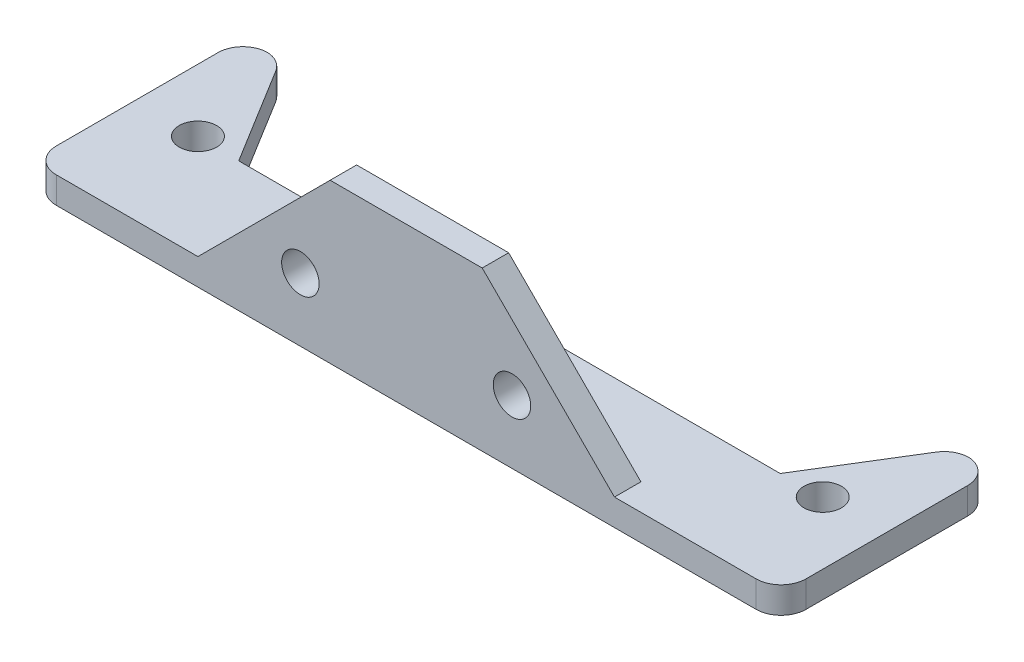
ISO-10303-21;
HEADER;
FILE_DESCRIPTION(('STEP AP214'),'2;1');
FILE_NAME('part.step','',(''),(''),'','','');
FILE_SCHEMA(('AUTOMOTIVE_DESIGN { 1 0 10303 214 1 1 1 1 }'));
ENDSEC;
DATA;
#1=APPLICATION_CONTEXT('core data for automotive mechanical design processes');
#2=APPLICATION_PROTOCOL_DEFINITION('international standard','automotive_design',2000,#1);
#3=PRODUCT_CONTEXT('',#1,'mechanical');
#4=PRODUCT('Part','Part','',(#3));
#5=PRODUCT_RELATED_PRODUCT_CATEGORY('part','',(#4));
#6=PRODUCT_DEFINITION_FORMATION('','',#4);
#7=PRODUCT_DEFINITION_CONTEXT('part definition',#1,'design');
#8=PRODUCT_DEFINITION('design','',#6,#7);
#9=PRODUCT_DEFINITION_SHAPE('','',#8);
#10=(LENGTH_UNIT() NAMED_UNIT(*) SI_UNIT(.MILLI.,.METRE.));
#11=(NAMED_UNIT(*) PLANE_ANGLE_UNIT() SI_UNIT($,.RADIAN.));
#12=(NAMED_UNIT(*) SI_UNIT($,.STERADIAN.) SOLID_ANGLE_UNIT());
#13=UNCERTAINTY_MEASURE_WITH_UNIT(LENGTH_MEASURE(1.E-05),#10,'distance_accuracy_value','');
#14=(GEOMETRIC_REPRESENTATION_CONTEXT(3) GLOBAL_UNCERTAINTY_ASSIGNED_CONTEXT((#13)) GLOBAL_UNIT_ASSIGNED_CONTEXT((#10,
#11,#12)) REPRESENTATION_CONTEXT('',''));
#15=CARTESIAN_POINT('',(0.,0.,0.));
#16=DIRECTION('',(0.,0.,1.));
#17=DIRECTION('',(1.,0.,0.));
#18=AXIS2_PLACEMENT_3D('',#15,#16,#17);
#19=CARTESIAN_POINT('',(25.,0.,-3.175));
#20=DIRECTION('',(0.,-1.,0.));
#21=DIRECTION('',(0.,0.,-1.));
#22=AXIS2_PLACEMENT_3D('',#19,#20,#21);
#23=PLANE('',#22);
#24=DIRECTION('',(-1.,0.,0.));
#25=VECTOR('',#24,1.);
#26=CARTESIAN_POINT('',(25.,0.,0.));
#27=LINE('',#26,#25);
#28=CARTESIAN_POINT('',(9.12500000000006,0.,0.));
#29=VERTEX_POINT('',#28);
#30=CARTESIAN_POINT('',(-9.12499999999983,0.,0.));
#31=VERTEX_POINT('',#30);
#32=EDGE_CURVE('E253',#29,#31,#27,.T.);
#33=ORIENTED_EDGE('',*,*,#32,.F.);
#34=DIRECTION('',(0.,0.,-1.));
#35=VECTOR('',#34,1.);
#36=CARTESIAN_POINT('',(9.12500000000006,0.,0.));
#37=LINE('',#36,#35);
#38=CARTESIAN_POINT('',(9.12500000000006,0.,-3.175));
#39=VERTEX_POINT('',#38);
#40=EDGE_CURVE('E237',#29,#39,#37,.T.);
#41=ORIENTED_EDGE('',*,*,#40,.T.);
#42=DIRECTION('',(-1.,0.,0.));
#43=VECTOR('',#42,1.);
#44=CARTESIAN_POINT('',(25.,0.,-3.175));
#45=LINE('',#44,#43);
#46=CARTESIAN_POINT('',(-9.12499999999983,0.,-3.175));
#47=VERTEX_POINT('',#46);
#48=EDGE_CURVE('E240',#39,#47,#45,.T.);
#49=ORIENTED_EDGE('',*,*,#48,.T.);
#50=DIRECTION('',(0.,0.,-1.));
#51=VECTOR('',#50,1.);
#52=CARTESIAN_POINT('',(-9.12499999999983,0.,0.));
#53=LINE('',#52,#51);
#54=EDGE_CURVE('E244',#31,#47,#53,.T.);
#55=ORIENTED_EDGE('',*,*,#54,.F.);
#56=EDGE_LOOP('',(#33,#41,#49,#55));
#57=FACE_BOUND('',#56,.T.);
#58=ADVANCED_FACE('F41',(#57),#23,.F.);
#59=CARTESIAN_POINT('',(25.,0.,0.));
#60=DIRECTION('',(0.,0.,-1.));
#61=DIRECTION('',(0.,1.,0.));
#62=AXIS2_PLACEMENT_3D('',#59,#60,#61);
#63=PLANE('',#62);
#64=CARTESIAN_POINT('',(12.7,-11.4453125,0.));
#65=DIRECTION('',(0.,0.,-1.));
#66=DIRECTION('',(0.,1.,0.));
#67=AXIS2_PLACEMENT_3D('',#64,#65,#66);
#68=CIRCLE('',#67,2.25);
#69=CARTESIAN_POINT('',(12.7,-9.1953125,0.));
#70=VERTEX_POINT('',#69);
#71=EDGE_CURVE('E222',#70,#70,#68,.T.);
#72=ORIENTED_EDGE('',*,*,#71,.T.);
#73=EDGE_LOOP('',(#72));
#74=FACE_BOUND('',#73,.T.);
#75=CARTESIAN_POINT('',(-12.7,-11.4453125,0.));
#76=DIRECTION('',(0.,0.,-1.));
#77=DIRECTION('',(0.,1.,0.));
#78=AXIS2_PLACEMENT_3D('',#75,#76,#77);
#79=CIRCLE('',#78,2.25);
#80=CARTESIAN_POINT('',(-12.7,-9.1953125,0.));
#81=VERTEX_POINT('',#80);
#82=EDGE_CURVE('E228',#81,#81,#79,.T.);
#83=ORIENTED_EDGE('',*,*,#82,.T.);
#84=EDGE_LOOP('',(#83));
#85=FACE_BOUND('',#84,.T.);
#86=DIRECTION('',(-1.,0.,0.));
#87=VECTOR('',#86,1.);
#88=CARTESIAN_POINT('',(25.,-19.05,0.));
#89=LINE('',#88,#87);
#90=CARTESIAN_POINT('',(42.,-19.05,0.));
#91=VERTEX_POINT('',#90);
#92=CARTESIAN_POINT('',(-42.,-19.05,0.));
#93=VERTEX_POINT('',#92);
#94=EDGE_CURVE('E250',#91,#93,#89,.T.);
#95=ORIENTED_EDGE('',*,*,#94,.F.);
#96=DIRECTION('',(0.,-1.,0.));
#97=VECTOR('',#96,1.);
#98=CARTESIAN_POINT('',(42.,-15.875,0.));
#99=LINE('',#98,#97);
#100=CARTESIAN_POINT('',(42.,-15.875,0.));
#101=VERTEX_POINT('',#100);
#102=EDGE_CURVE('E293',#91,#101,#99,.F.);
#103=ORIENTED_EDGE('',*,*,#102,.T.);
#104=DIRECTION('',(-1.,0.,0.));
#105=VECTOR('',#104,1.);
#106=CARTESIAN_POINT('',(45.,-15.875,0.));
#107=LINE('',#106,#105);
#108=CARTESIAN_POINT('',(25.,-15.875,0.));
#109=VERTEX_POINT('',#108);
#110=EDGE_CURVE('E217',#101,#109,#107,.T.);
#111=ORIENTED_EDGE('',*,*,#110,.T.);
#112=DIRECTION('',(-0.707106781186546,0.707106781186549,0.));
#113=VECTOR('',#112,1.);
#114=CARTESIAN_POINT('',(25.,-15.875,0.));
#115=LINE('',#114,#113);
#116=EDGE_CURVE('E232',#109,#29,#115,.T.);
#117=ORIENTED_EDGE('',*,*,#116,.T.);
#118=ORIENTED_EDGE('',*,*,#32,.T.);
#119=DIRECTION('',(-0.707106781186551,-0.707106781186544,0.));
#120=VECTOR('',#119,1.);
#121=CARTESIAN_POINT('',(-25.,-15.875,0.));
#122=LINE('',#121,#120);
#123=CARTESIAN_POINT('',(-25.,-15.875,0.));
#124=VERTEX_POINT('',#123);
#125=EDGE_CURVE('E241',#31,#124,#122,.T.);
#126=ORIENTED_EDGE('',*,*,#125,.T.);
#127=DIRECTION('',(1.,0.,0.));
#128=VECTOR('',#127,1.);
#129=CARTESIAN_POINT('',(-45.,-15.875,0.));
#130=LINE('',#129,#128);
#131=CARTESIAN_POINT('',(-42.,-15.875,0.));
#132=VERTEX_POINT('',#131);
#133=EDGE_CURVE('E209',#132,#124,#130,.T.);
#134=ORIENTED_EDGE('',*,*,#133,.F.);
#135=DIRECTION('',(0.,1.,0.));
#136=VECTOR('',#135,1.);
#137=CARTESIAN_POINT('',(-42.,-19.05,0.));
#138=LINE('',#137,#136);
#139=EDGE_CURVE('E291',#132,#93,#138,.F.);
#140=ORIENTED_EDGE('',*,*,#139,.T.);
#141=EDGE_LOOP('',(#95,#103,#111,#117,#118,#126,#134,#140));
#142=FACE_BOUND('',#141,.T.);
#143=ADVANCED_FACE('F331',(#74,#85,#142),#63,.F.);
#144=CARTESIAN_POINT('',(25.,-19.05,0.));
#145=DIRECTION('',(0.,1.,0.));
#146=DIRECTION('',(0.,0.,1.));
#147=AXIS2_PLACEMENT_3D('',#144,#145,#146);
#148=PLANE('',#147);
#149=CARTESIAN_POINT('',(37.5,-19.05,-12.5));
#150=DIRECTION('',(0.,1.,0.));
#151=DIRECTION('',(0.,0.,1.));
#152=AXIS2_PLACEMENT_3D('',#149,#150,#151);
#153=CIRCLE('',#152,2.25);
#154=CARTESIAN_POINT('',(37.5,-19.05,-10.25));
#155=VERTEX_POINT('',#154);
#156=EDGE_CURVE('E194',#155,#155,#153,.T.);
#157=ORIENTED_EDGE('',*,*,#156,.T.);
#158=EDGE_LOOP('',(#157));
#159=FACE_BOUND('',#158,.T.);
#160=CARTESIAN_POINT('',(-37.5,-19.05,-12.5));
#161=DIRECTION('',(0.,1.,0.));
#162=DIRECTION('',(0.,0.,1.));
#163=AXIS2_PLACEMENT_3D('',#160,#161,#162);
#164=CIRCLE('',#163,2.25);
#165=CARTESIAN_POINT('',(-37.5,-19.05,-10.25));
#166=VERTEX_POINT('',#165);
#167=EDGE_CURVE('E200',#166,#166,#164,.T.);
#168=ORIENTED_EDGE('',*,*,#167,.T.);
#169=EDGE_LOOP('',(#168));
#170=FACE_BOUND('',#169,.T.);
#171=DIRECTION('',(0.,0.,-1.));
#172=VECTOR('',#171,1.);
#173=CARTESIAN_POINT('',(45.,-19.05,0.));
#174=LINE('',#173,#172);
#175=CARTESIAN_POINT('',(45.,-19.05,-3.));
#176=VERTEX_POINT('',#175);
#177=CARTESIAN_POINT('',(45.,-19.05,-22.4));
#178=VERTEX_POINT('',#177);
#179=EDGE_CURVE('E211',#176,#178,#174,.T.);
#180=ORIENTED_EDGE('',*,*,#179,.F.);
#181=CARTESIAN_POINT('',(42.,-19.05,-3.));
#182=DIRECTION('',(0.,1.,0.));
#183=DIRECTION('',(0.,0.,1.));
#184=AXIS2_PLACEMENT_3D('',#181,#182,#183);
#185=CIRCLE('',#184,3.);
#186=EDGE_CURVE('E289',#176,#91,#185,.F.);
#187=ORIENTED_EDGE('',*,*,#186,.T.);
#188=ORIENTED_EDGE('',*,*,#94,.T.);
#189=CARTESIAN_POINT('',(-42.,-19.05,-3.));
#190=DIRECTION('',(0.,1.,0.));
#191=DIRECTION('',(0.,0.,1.));
#192=AXIS2_PLACEMENT_3D('',#189,#190,#191);
#193=CIRCLE('',#192,3.);
#194=CARTESIAN_POINT('',(-45.,-19.05,-3.));
#195=VERTEX_POINT('',#194);
#196=EDGE_CURVE('E287',#93,#195,#193,.F.);
#197=ORIENTED_EDGE('',*,*,#196,.T.);
#198=DIRECTION('',(0.,0.,1.));
#199=VECTOR('',#198,1.);
#200=CARTESIAN_POINT('',(-45.,-19.05,-25.4));
#201=LINE('',#200,#199);
#202=CARTESIAN_POINT('',(-45.,-19.05,-22.4));
#203=VERTEX_POINT('',#202);
#204=EDGE_CURVE('E203',#203,#195,#201,.T.);
#205=ORIENTED_EDGE('',*,*,#204,.F.);
#206=CARTESIAN_POINT('',(-42.,-19.05,-22.4));
#207=DIRECTION('',(0.,1.,0.));
#208=DIRECTION('',(0.,0.,1.));
#209=AXIS2_PLACEMENT_3D('',#206,#207,#208);
#210=CIRCLE('',#209,3.);
#211=CARTESIAN_POINT('',(-42.0881927910547,-19.05,-25.3987033917355));
#212=VERTEX_POINT('',#211);
#213=EDGE_CURVE('E285',#203,#212,#210,.F.);
#214=ORIENTED_EDGE('',*,*,#213,.T.);
#215=CARTESIAN_POINT('',(-42.1763855821093,-19.05,-22.4));
#216=DIRECTION('',(0.,1.,0.));
#217=DIRECTION('',(0.,0.,1.));
#218=AXIS2_PLACEMENT_3D('',#215,#216,#217);
#219=CIRCLE('',#218,3.);
#220=CARTESIAN_POINT('',(-39.6214106319957,-19.05,-23.972292276993));
#221=VERTEX_POINT('',#220);
#222=EDGE_CURVE('E283',#212,#221,#219,.F.);
#223=ORIENTED_EDGE('',*,*,#222,.T.);
#224=DIRECTION('',(0.524097425664335,0.,0.851658316704544));
#225=VECTOR('',#224,1.);
#226=CARTESIAN_POINT('',(-18.0381974248927,-19.05,11.1004291845494));
#227=LINE('',#226,#225);
#228=CARTESIAN_POINT('',(-32.5,-19.05,-12.4));
#229=VERTEX_POINT('',#228);
#230=EDGE_CURVE('E169',#221,#229,#227,.T.);
#231=ORIENTED_EDGE('',*,*,#230,.T.);
#232=DIRECTION('',(1.,0.,0.));
#233=VECTOR('',#232,1.);
#234=CARTESIAN_POINT('',(0.,-19.05,-12.4));
#235=LINE('',#234,#233);
#236=CARTESIAN_POINT('',(32.5,-19.05,-12.4));
#237=VERTEX_POINT('',#236);
#238=EDGE_CURVE('E162',#229,#237,#235,.T.);
#239=ORIENTED_EDGE('',*,*,#238,.T.);
#240=DIRECTION('',(0.524097425664335,0.,-0.851658316704544));
#241=VECTOR('',#240,1.);
#242=CARTESIAN_POINT('',(18.0381974248927,-19.05,11.1004291845494));
#243=LINE('',#242,#241);
#244=CARTESIAN_POINT('',(39.6214106319957,-19.05,-23.972292276993));
#245=VERTEX_POINT('',#244);
#246=EDGE_CURVE('E172',#237,#245,#243,.T.);
#247=ORIENTED_EDGE('',*,*,#246,.T.);
#248=CARTESIAN_POINT('',(42.1763855821093,-19.05,-22.4));
#249=DIRECTION('',(0.,1.,0.));
#250=DIRECTION('',(0.,0.,1.));
#251=AXIS2_PLACEMENT_3D('',#248,#249,#250);
#252=CIRCLE('',#251,3.);
#253=CARTESIAN_POINT('',(42.0881927910547,-19.05,-25.3987033917355));
#254=VERTEX_POINT('',#253);
#255=EDGE_CURVE('E281',#245,#254,#252,.F.);
#256=ORIENTED_EDGE('',*,*,#255,.T.);
#257=CARTESIAN_POINT('',(42.,-19.05,-22.4));
#258=DIRECTION('',(0.,1.,0.));
#259=DIRECTION('',(0.,0.,1.));
#260=AXIS2_PLACEMENT_3D('',#257,#258,#259);
#261=CIRCLE('',#260,3.);
#262=EDGE_CURVE('E279',#254,#178,#261,.F.);
#263=ORIENTED_EDGE('',*,*,#262,.T.);
#264=EDGE_LOOP('',(#180,#187,#188,#197,#205,#214,#223,#231,#239,#247,#256,#263));
#265=FACE_BOUND('',#264,.T.);
#266=ADVANCED_FACE('F178',(#159,#170,#265),#148,.F.);
#267=CARTESIAN_POINT('',(25.,-15.875,-25.4));
#268=DIRECTION('',(0.,-1.,0.));
#269=DIRECTION('',(0.,0.,-1.));
#270=AXIS2_PLACEMENT_3D('',#267,#268,#269);
#271=PLANE('',#270);
#272=CARTESIAN_POINT('',(37.5,-15.875,-12.5));
#273=DIRECTION('',(0.,1.,0.));
#274=DIRECTION('',(0.,0.,1.));
#275=AXIS2_PLACEMENT_3D('',#272,#273,#274);
#276=CIRCLE('',#275,2.24999999999999);
#277=CARTESIAN_POINT('',(37.5,-15.875,-10.25));
#278=VERTEX_POINT('',#277);
#279=EDGE_CURVE('E190',#278,#278,#276,.T.);
#280=ORIENTED_EDGE('',*,*,#279,.F.);
#281=EDGE_LOOP('',(#280));
#282=FACE_BOUND('',#281,.T.);
#283=CARTESIAN_POINT('',(-37.5,-15.875,-12.5));
#284=DIRECTION('',(0.,1.,0.));
#285=DIRECTION('',(0.,0.,1.));
#286=AXIS2_PLACEMENT_3D('',#283,#284,#285);
#287=CIRCLE('',#286,2.24999999999999);
#288=CARTESIAN_POINT('',(-37.5,-15.875,-10.25));
#289=VERTEX_POINT('',#288);
#290=EDGE_CURVE('E197',#289,#289,#287,.T.);
#291=ORIENTED_EDGE('',*,*,#290,.F.);
#292=EDGE_LOOP('',(#291));
#293=FACE_BOUND('',#292,.T.);
#294=ORIENTED_EDGE('',*,*,#110,.F.);
#295=CARTESIAN_POINT('',(42.,-15.875,-3.));
#296=DIRECTION('',(0.,-1.,0.));
#297=DIRECTION('',(0.,0.,-1.));
#298=AXIS2_PLACEMENT_3D('',#295,#296,#297);
#299=CIRCLE('',#298,3.);
#300=CARTESIAN_POINT('',(45.,-15.875,-3.));
#301=VERTEX_POINT('',#300);
#302=EDGE_CURVE('E303',#101,#301,#299,.F.);
#303=ORIENTED_EDGE('',*,*,#302,.T.);
#304=DIRECTION('',(0.,0.,1.));
#305=VECTOR('',#304,1.);
#306=CARTESIAN_POINT('',(45.,-15.875,0.));
#307=LINE('',#306,#305);
#308=CARTESIAN_POINT('',(45.,-15.875,-22.4));
#309=VERTEX_POINT('',#308);
#310=EDGE_CURVE('E214',#309,#301,#307,.T.);
#311=ORIENTED_EDGE('',*,*,#310,.F.);
#312=CARTESIAN_POINT('',(42.,-15.875,-22.4));
#313=DIRECTION('',(0.,-1.,0.));
#314=DIRECTION('',(0.,0.,-1.));
#315=AXIS2_PLACEMENT_3D('',#312,#313,#314);
#316=CIRCLE('',#315,3.);
#317=CARTESIAN_POINT('',(42.0881927910547,-15.875,-25.3987033917355));
#318=VERTEX_POINT('',#317);
#319=EDGE_CURVE('E65',#309,#318,#316,.F.);
#320=ORIENTED_EDGE('',*,*,#319,.T.);
#321=CARTESIAN_POINT('',(42.1763855821093,-15.875,-22.4));
#322=DIRECTION('',(0.,-1.,0.));
#323=DIRECTION('',(0.,0.,-1.));
#324=AXIS2_PLACEMENT_3D('',#321,#322,#323);
#325=CIRCLE('',#324,3.);
#326=CARTESIAN_POINT('',(39.6214106319957,-15.875,-23.972292276993));
#327=VERTEX_POINT('',#326);
#328=EDGE_CURVE('E296',#318,#327,#325,.F.);
#329=ORIENTED_EDGE('',*,*,#328,.T.);
#330=DIRECTION('',(0.524097425664335,0.,-0.851658316704544));
#331=VECTOR('',#330,1.);
#332=CARTESIAN_POINT('',(18.0381974248927,-15.875,11.1004291845494));
#333=LINE('',#332,#331);
#334=CARTESIAN_POINT('',(32.5,-15.875,-12.4));
#335=VERTEX_POINT('',#334);
#336=EDGE_CURVE('E183',#335,#327,#333,.T.);
#337=ORIENTED_EDGE('',*,*,#336,.F.);
#338=DIRECTION('',(1.,0.,0.));
#339=VECTOR('',#338,1.);
#340=CARTESIAN_POINT('',(0.,-15.875,-12.4));
#341=LINE('',#340,#339);
#342=CARTESIAN_POINT('',(-32.5,-15.875,-12.4));
#343=VERTEX_POINT('',#342);
#344=EDGE_CURVE('E164',#343,#335,#341,.T.);
#345=ORIENTED_EDGE('',*,*,#344,.F.);
#346=DIRECTION('',(0.524097425664335,0.,0.851658316704544));
#347=VECTOR('',#346,1.);
#348=CARTESIAN_POINT('',(-18.0381974248927,-15.875,11.1004291845494));
#349=LINE('',#348,#347);
#350=CARTESIAN_POINT('',(-39.6214106319957,-15.875,-23.972292276993));
#351=VERTEX_POINT('',#350);
#352=EDGE_CURVE('E181',#351,#343,#349,.T.);
#353=ORIENTED_EDGE('',*,*,#352,.F.);
#354=CARTESIAN_POINT('',(-42.1763855821093,-15.875,-22.4));
#355=DIRECTION('',(0.,-1.,0.));
#356=DIRECTION('',(0.,0.,-1.));
#357=AXIS2_PLACEMENT_3D('',#354,#355,#356);
#358=CIRCLE('',#357,3.);
#359=CARTESIAN_POINT('',(-42.0881927910547,-15.875,-25.3987033917355));
#360=VERTEX_POINT('',#359);
#361=EDGE_CURVE('E58',#351,#360,#358,.F.);
#362=ORIENTED_EDGE('',*,*,#361,.T.);
#363=CARTESIAN_POINT('',(-42.,-15.875,-22.4));
#364=DIRECTION('',(0.,-1.,0.));
#365=DIRECTION('',(0.,0.,-1.));
#366=AXIS2_PLACEMENT_3D('',#363,#364,#365);
#367=CIRCLE('',#366,3.);
#368=CARTESIAN_POINT('',(-45.,-15.875,-22.4));
#369=VERTEX_POINT('',#368);
#370=EDGE_CURVE('E299',#360,#369,#367,.F.);
#371=ORIENTED_EDGE('',*,*,#370,.T.);
#372=DIRECTION('',(0.,0.,-1.));
#373=VECTOR('',#372,1.);
#374=CARTESIAN_POINT('',(-45.,-15.875,-25.4));
#375=LINE('',#374,#373);
#376=CARTESIAN_POINT('',(-45.,-15.875,-3.));
#377=VERTEX_POINT('',#376);
#378=EDGE_CURVE('E206',#377,#369,#375,.T.);
#379=ORIENTED_EDGE('',*,*,#378,.F.);
#380=CARTESIAN_POINT('',(-42.,-15.875,-3.));
#381=DIRECTION('',(0.,-1.,0.));
#382=DIRECTION('',(0.,0.,-1.));
#383=AXIS2_PLACEMENT_3D('',#380,#381,#382);
#384=CIRCLE('',#383,3.);
#385=EDGE_CURVE('E301',#377,#132,#384,.F.);
#386=ORIENTED_EDGE('',*,*,#385,.T.);
#387=ORIENTED_EDGE('',*,*,#133,.T.);
#388=DIRECTION('',(0.,0.,-1.));
#389=VECTOR('',#388,1.);
#390=CARTESIAN_POINT('',(-25.,-15.875,0.));
#391=LINE('',#390,#389);
#392=CARTESIAN_POINT('',(-25.,-15.875,-3.175));
#393=VERTEX_POINT('',#392);
#394=EDGE_CURVE('E246',#124,#393,#391,.T.);
#395=ORIENTED_EDGE('',*,*,#394,.T.);
#396=DIRECTION('',(-1.,0.,0.));
#397=VECTOR('',#396,1.);
#398=CARTESIAN_POINT('',(25.,-15.875,-3.175));
#399=LINE('',#398,#397);
#400=CARTESIAN_POINT('',(25.,-15.875,-3.175));
#401=VERTEX_POINT('',#400);
#402=EDGE_CURVE('E249',#401,#393,#399,.T.);
#403=ORIENTED_EDGE('',*,*,#402,.F.);
#404=DIRECTION('',(0.,0.,-1.));
#405=VECTOR('',#404,1.);
#406=CARTESIAN_POINT('',(25.,-15.875,0.));
#407=LINE('',#406,#405);
#408=EDGE_CURVE('E235',#109,#401,#407,.T.);
#409=ORIENTED_EDGE('',*,*,#408,.F.);
#410=EDGE_LOOP('',(#294,#303,#311,#320,#329,#337,#345,#353,#362,#371,#379,#386,#387,#395,#403,#409));
#411=FACE_BOUND('',#410,.T.);
#412=ADVANCED_FACE('F350',(#282,#293,#411),#271,.F.);
#413=CARTESIAN_POINT('',(25.,-15.875,-3.175));
#414=DIRECTION('',(0.,0.,1.));
#415=DIRECTION('',(0.,-1.,0.));
#416=AXIS2_PLACEMENT_3D('',#413,#414,#415);
#417=PLANE('',#416);
#418=CARTESIAN_POINT('',(12.7,-11.4453125,-3.175));
#419=DIRECTION('',(0.,0.,-1.));
#420=DIRECTION('',(0.,1.,0.));
#421=AXIS2_PLACEMENT_3D('',#418,#419,#420);
#422=CIRCLE('',#421,2.24999999999999);
#423=CARTESIAN_POINT('',(12.7,-9.19531250000001,-3.175));
#424=VERTEX_POINT('',#423);
#425=EDGE_CURVE('E219',#424,#424,#422,.T.);
#426=ORIENTED_EDGE('',*,*,#425,.F.);
#427=EDGE_LOOP('',(#426));
#428=FACE_BOUND('',#427,.T.);
#429=CARTESIAN_POINT('',(-12.7,-11.4453125,-3.175));
#430=DIRECTION('',(0.,0.,-1.));
#431=DIRECTION('',(0.,1.,0.));
#432=AXIS2_PLACEMENT_3D('',#429,#430,#431);
#433=CIRCLE('',#432,2.24999999999999);
#434=CARTESIAN_POINT('',(-12.7,-9.19531250000001,-3.175));
#435=VERTEX_POINT('',#434);
#436=EDGE_CURVE('E225',#435,#435,#433,.T.);
#437=ORIENTED_EDGE('',*,*,#436,.F.);
#438=EDGE_LOOP('',(#437));
#439=FACE_BOUND('',#438,.T.);
#440=ORIENTED_EDGE('',*,*,#48,.F.);
#441=DIRECTION('',(-0.707106781186546,0.707106781186549,0.));
#442=VECTOR('',#441,1.);
#443=CARTESIAN_POINT('',(25.,-15.875,-3.175));
#444=LINE('',#443,#442);
#445=EDGE_CURVE('E236',#401,#39,#444,.T.);
#446=ORIENTED_EDGE('',*,*,#445,.F.);
#447=ORIENTED_EDGE('',*,*,#402,.T.);
#448=DIRECTION('',(-0.707106781186551,-0.707106781186544,0.));
#449=VECTOR('',#448,1.);
#450=CARTESIAN_POINT('',(-25.,-15.875,-3.175));
#451=LINE('',#450,#449);
#452=EDGE_CURVE('E231',#47,#393,#451,.T.);
#453=ORIENTED_EDGE('',*,*,#452,.F.);
#454=EDGE_LOOP('',(#440,#446,#447,#453));
#455=FACE_BOUND('',#454,.T.);
#456=ADVANCED_FACE('F353',(#428,#439,#455),#417,.F.);
#457=CARTESIAN_POINT('',(-25.,-15.875,0.));
#458=DIRECTION('',(0.707106781186544,-0.707106781186551,0.));
#459=DIRECTION('',(0.707106781186551,0.707106781186544,0.));
#460=AXIS2_PLACEMENT_3D('',#457,#458,#459);
#461=PLANE('',#460);
#462=ORIENTED_EDGE('',*,*,#452,.T.);
#463=ORIENTED_EDGE('',*,*,#394,.F.);
#464=ORIENTED_EDGE('',*,*,#125,.F.);
#465=ORIENTED_EDGE('',*,*,#54,.T.);
#466=EDGE_LOOP('',(#462,#463,#464,#465));
#467=FACE_BOUND('',#466,.T.);
#468=ADVANCED_FACE('F361',(#467),#461,.F.);
#469=CARTESIAN_POINT('',(25.,-15.875,0.));
#470=DIRECTION('',(-0.707106781186549,-0.707106781186546,0.));
#471=DIRECTION('',(0.707106781186546,-0.707106781186549,0.));
#472=AXIS2_PLACEMENT_3D('',#469,#470,#471);
#473=PLANE('',#472);
#474=ORIENTED_EDGE('',*,*,#445,.T.);
#475=ORIENTED_EDGE('',*,*,#40,.F.);
#476=ORIENTED_EDGE('',*,*,#116,.F.);
#477=ORIENTED_EDGE('',*,*,#408,.T.);
#478=EDGE_LOOP('',(#474,#475,#476,#477));
#479=FACE_BOUND('',#478,.T.);
#480=ADVANCED_FACE('F484',(#479),#473,.F.);
#481=CARTESIAN_POINT('',(-12.7,-11.4453125,-3.175));
#482=DIRECTION('',(0.,0.,-1.));
#483=DIRECTION('',(0.,1.,0.));
#484=AXIS2_PLACEMENT_3D('',#481,#482,#483);
#485=CYLINDRICAL_SURFACE('',#484,2.24999999999999);
#486=ORIENTED_EDGE('',*,*,#82,.F.);
#487=EDGE_LOOP('',(#486));
#488=FACE_BOUND('',#487,.T.);
#489=ORIENTED_EDGE('',*,*,#436,.T.);
#490=EDGE_LOOP('',(#489));
#491=FACE_BOUND('',#490,.T.);
#492=ADVANCED_FACE('F492',(#488,#491),#485,.F.);
#493=CARTESIAN_POINT('',(12.7,-11.4453125,-3.175));
#494=DIRECTION('',(0.,0.,-1.));
#495=DIRECTION('',(0.,1.,0.));
#496=AXIS2_PLACEMENT_3D('',#493,#494,#495);
#497=CYLINDRICAL_SURFACE('',#496,2.24999999999999);
#498=ORIENTED_EDGE('',*,*,#71,.F.);
#499=EDGE_LOOP('',(#498));
#500=FACE_BOUND('',#499,.T.);
#501=ORIENTED_EDGE('',*,*,#425,.T.);
#502=EDGE_LOOP('',(#501));
#503=FACE_BOUND('',#502,.T.);
#504=ADVANCED_FACE('F440',(#500,#503),#497,.F.);
#505=CARTESIAN_POINT('',(45.,0.,0.));
#506=DIRECTION('',(1.,0.,0.));
#507=DIRECTION('',(0.,0.,-1.));
#508=AXIS2_PLACEMENT_3D('',#505,#506,#507);
#509=PLANE('',#508);
#510=ORIENTED_EDGE('',*,*,#310,.T.);
#511=DIRECTION('',(0.,-1.,0.));
#512=VECTOR('',#511,1.);
#513=CARTESIAN_POINT('',(45.,-19.05,-3.));
#514=LINE('',#513,#512);
#515=EDGE_CURVE('E276',#301,#176,#514,.T.);
#516=ORIENTED_EDGE('',*,*,#515,.T.);
#517=ORIENTED_EDGE('',*,*,#179,.T.);
#518=DIRECTION('',(0.,1.,0.));
#519=VECTOR('',#518,1.);
#520=CARTESIAN_POINT('',(45.,-15.875,-22.4));
#521=LINE('',#520,#519);
#522=EDGE_CURVE('E256',#178,#309,#521,.T.);
#523=ORIENTED_EDGE('',*,*,#522,.T.);
#524=EDGE_LOOP('',(#510,#516,#517,#523));
#525=FACE_BOUND('',#524,.T.);
#526=ADVANCED_FACE('F322',(#525),#509,.T.);
#527=CARTESIAN_POINT('',(-45.,0.,0.));
#528=DIRECTION('',(-1.,0.,0.));
#529=DIRECTION('',(0.,0.,1.));
#530=AXIS2_PLACEMENT_3D('',#527,#528,#529);
#531=PLANE('',#530);
#532=ORIENTED_EDGE('',*,*,#204,.T.);
#533=DIRECTION('',(0.,1.,0.));
#534=VECTOR('',#533,1.);
#535=CARTESIAN_POINT('',(-45.,-15.875,-3.));
#536=LINE('',#535,#534);
#537=EDGE_CURVE('E308',#195,#377,#536,.T.);
#538=ORIENTED_EDGE('',*,*,#537,.T.);
#539=ORIENTED_EDGE('',*,*,#378,.T.);
#540=DIRECTION('',(0.,-1.,0.));
#541=VECTOR('',#540,1.);
#542=CARTESIAN_POINT('',(-45.,-19.05,-22.4));
#543=LINE('',#542,#541);
#544=EDGE_CURVE('E305',#369,#203,#543,.T.);
#545=ORIENTED_EDGE('',*,*,#544,.T.);
#546=EDGE_LOOP('',(#532,#538,#539,#545));
#547=FACE_BOUND('',#546,.T.);
#548=ADVANCED_FACE('F340',(#547),#531,.T.);
#549=CARTESIAN_POINT('',(-37.5,-15.875,-12.5));
#550=DIRECTION('',(0.,1.,0.));
#551=DIRECTION('',(0.,0.,1.));
#552=AXIS2_PLACEMENT_3D('',#549,#550,#551);
#553=CYLINDRICAL_SURFACE('',#552,2.25);
#554=ORIENTED_EDGE('',*,*,#167,.F.);
#555=EDGE_LOOP('',(#554));
#556=FACE_BOUND('',#555,.T.);
#557=ORIENTED_EDGE('',*,*,#290,.T.);
#558=EDGE_LOOP('',(#557));
#559=FACE_BOUND('',#558,.T.);
#560=ADVANCED_FACE('F433',(#556,#559),#553,.F.);
#561=CARTESIAN_POINT('',(37.5,-15.875,-12.5));
#562=DIRECTION('',(0.,1.,0.));
#563=DIRECTION('',(0.,0.,1.));
#564=AXIS2_PLACEMENT_3D('',#561,#562,#563);
#565=CYLINDRICAL_SURFACE('',#564,2.25);
#566=ORIENTED_EDGE('',*,*,#156,.F.);
#567=EDGE_LOOP('',(#566));
#568=FACE_BOUND('',#567,.T.);
#569=ORIENTED_EDGE('',*,*,#279,.T.);
#570=EDGE_LOOP('',(#569));
#571=FACE_BOUND('',#570,.T.);
#572=ADVANCED_FACE('F511',(#568,#571),#565,.F.);
#573=CARTESIAN_POINT('',(0.,-19.05,-12.4));
#574=DIRECTION('',(0.,0.,1.));
#575=DIRECTION('',(0.,-1.,0.));
#576=AXIS2_PLACEMENT_3D('',#573,#574,#575);
#577=PLANE('',#576);
#578=ORIENTED_EDGE('',*,*,#344,.T.);
#579=DIRECTION('',(0.,1.,0.));
#580=VECTOR('',#579,1.);
#581=CARTESIAN_POINT('',(32.5,-19.05,-12.4));
#582=LINE('',#581,#580);
#583=EDGE_CURVE('E157',#237,#335,#582,.T.);
#584=ORIENTED_EDGE('',*,*,#583,.F.);
#585=ORIENTED_EDGE('',*,*,#238,.F.);
#586=DIRECTION('',(0.,1.,0.));
#587=VECTOR('',#586,1.);
#588=CARTESIAN_POINT('',(-32.5,-19.05,-12.4));
#589=LINE('',#588,#587);
#590=EDGE_CURVE('E168',#229,#343,#589,.T.);
#591=ORIENTED_EDGE('',*,*,#590,.T.);
#592=EDGE_LOOP('',(#578,#584,#585,#591));
#593=FACE_BOUND('',#592,.T.);
#594=ADVANCED_FACE('F159',(#593),#577,.F.);
#595=CARTESIAN_POINT('',(-18.0381974248927,-19.05,11.1004291845494));
#596=DIRECTION('',(-0.851658316704544,0.,0.524097425664335));
#597=DIRECTION('',(0.524097425664335,0.,0.851658316704544));
#598=AXIS2_PLACEMENT_3D('',#595,#596,#597);
#599=PLANE('',#598);
#600=ORIENTED_EDGE('',*,*,#230,.F.);
#601=DIRECTION('',(0.,1.,0.));
#602=VECTOR('',#601,1.);
#603=CARTESIAN_POINT('',(-39.6214106319957,-19.05,-23.972292276993));
#604=LINE('',#603,#602);
#605=EDGE_CURVE('E50',#221,#351,#604,.T.);
#606=ORIENTED_EDGE('',*,*,#605,.T.);
#607=ORIENTED_EDGE('',*,*,#352,.T.);
#608=ORIENTED_EDGE('',*,*,#590,.F.);
#609=EDGE_LOOP('',(#600,#606,#607,#608));
#610=FACE_BOUND('',#609,.T.);
#611=ADVANCED_FACE('F349',(#610),#599,.F.);
#612=CARTESIAN_POINT('',(18.0381974248927,-19.05,11.1004291845494));
#613=DIRECTION('',(0.851658316704544,0.,0.524097425664335));
#614=DIRECTION('',(0.524097425664335,0.,-0.851658316704544));
#615=AXIS2_PLACEMENT_3D('',#612,#613,#614);
#616=PLANE('',#615);
#617=ORIENTED_EDGE('',*,*,#336,.T.);
#618=DIRECTION('',(0.,1.,0.));
#619=VECTOR('',#618,1.);
#620=CARTESIAN_POINT('',(39.6214106319957,-19.05,-23.972292276993));
#621=LINE('',#620,#619);
#622=EDGE_CURVE('E11',#327,#245,#621,.F.);
#623=ORIENTED_EDGE('',*,*,#622,.T.);
#624=ORIENTED_EDGE('',*,*,#246,.F.);
#625=ORIENTED_EDGE('',*,*,#583,.T.);
#626=EDGE_LOOP('',(#617,#623,#624,#625));
#627=FACE_BOUND('',#626,.T.);
#628=ADVANCED_FACE('F173',(#627),#616,.F.);
#629=CARTESIAN_POINT('',(42.,0.,-3.));
#630=DIRECTION('',(0.,1.,0.));
#631=DIRECTION('',(0.,0.,1.));
#632=AXIS2_PLACEMENT_3D('',#629,#630,#631);
#633=CYLINDRICAL_SURFACE('',#632,3.);
#634=ORIENTED_EDGE('',*,*,#302,.F.);
#635=ORIENTED_EDGE('',*,*,#102,.F.);
#636=ORIENTED_EDGE('',*,*,#186,.F.);
#637=ORIENTED_EDGE('',*,*,#515,.F.);
#638=EDGE_LOOP('',(#634,#635,#636,#637));
#639=FACE_BOUND('',#638,.T.);
#640=ADVANCED_FACE('F326',(#639),#633,.T.);
#641=CARTESIAN_POINT('',(-42.,0.,-3.));
#642=DIRECTION('',(0.,-1.,0.));
#643=DIRECTION('',(0.,0.,-1.));
#644=AXIS2_PLACEMENT_3D('',#641,#642,#643);
#645=CYLINDRICAL_SURFACE('',#644,3.);
#646=ORIENTED_EDGE('',*,*,#196,.F.);
#647=ORIENTED_EDGE('',*,*,#139,.F.);
#648=ORIENTED_EDGE('',*,*,#385,.F.);
#649=ORIENTED_EDGE('',*,*,#537,.F.);
#650=EDGE_LOOP('',(#646,#647,#648,#649));
#651=FACE_BOUND('',#650,.T.);
#652=ADVANCED_FACE('F336',(#651),#645,.T.);
#653=CARTESIAN_POINT('',(-42.1763855821093,-19.05,-22.4));
#654=DIRECTION('',(0.,1.,0.));
#655=DIRECTION('',(-1.,0.,0.));
#656=AXIS2_PLACEMENT_3D('',#653,#654,#655);
#657=CYLINDRICAL_SURFACE('',#656,3.);
#658=DIRECTION('',(0.,1.,0.));
#659=VECTOR('',#658,1.);
#660=CARTESIAN_POINT('',(-42.0881927910547,-17.4625,-25.3987033917355));
#661=LINE('',#660,#659);
#662=EDGE_CURVE('E188',#360,#212,#661,.F.);
#663=ORIENTED_EDGE('',*,*,#662,.F.);
#664=ORIENTED_EDGE('',*,*,#361,.F.);
#665=ORIENTED_EDGE('',*,*,#605,.F.);
#666=ORIENTED_EDGE('',*,*,#222,.F.);
#667=EDGE_LOOP('',(#663,#664,#665,#666));
#668=FACE_BOUND('',#667,.T.);
#669=ADVANCED_FACE('F347',(#668),#657,.T.);
#670=CARTESIAN_POINT('',(-42.,0.,-22.4));
#671=DIRECTION('',(0.,1.,0.));
#672=DIRECTION('',(0.,0.,1.));
#673=AXIS2_PLACEMENT_3D('',#670,#671,#672);
#674=CYLINDRICAL_SURFACE('',#673,3.);
#675=ORIENTED_EDGE('',*,*,#370,.F.);
#676=ORIENTED_EDGE('',*,*,#662,.T.);
#677=ORIENTED_EDGE('',*,*,#213,.F.);
#678=ORIENTED_EDGE('',*,*,#544,.F.);
#679=EDGE_LOOP('',(#675,#676,#677,#678));
#680=FACE_BOUND('',#679,.T.);
#681=ADVANCED_FACE('F343',(#680),#674,.T.);
#682=CARTESIAN_POINT('',(42.,0.,-22.4));
#683=DIRECTION('',(0.,-1.,0.));
#684=DIRECTION('',(0.,0.,-1.));
#685=AXIS2_PLACEMENT_3D('',#682,#683,#684);
#686=CYLINDRICAL_SURFACE('',#685,3.);
#687=ORIENTED_EDGE('',*,*,#522,.F.);
#688=ORIENTED_EDGE('',*,*,#262,.F.);
#689=DIRECTION('',(0.,-1.,0.));
#690=VECTOR('',#689,1.);
#691=CARTESIAN_POINT('',(42.0881927910547,-17.4625,-25.3987033917355));
#692=LINE('',#691,#690);
#693=EDGE_CURVE('E45',#318,#254,#692,.T.);
#694=ORIENTED_EDGE('',*,*,#693,.F.);
#695=ORIENTED_EDGE('',*,*,#319,.F.);
#696=EDGE_LOOP('',(#687,#688,#694,#695));
#697=FACE_BOUND('',#696,.T.);
#698=ADVANCED_FACE('F43',(#697),#686,.T.);
#699=CARTESIAN_POINT('',(42.1763855821093,-19.05,-22.4));
#700=DIRECTION('',(0.,1.,0.));
#701=DIRECTION('',(-1.,0.,0.));
#702=AXIS2_PLACEMENT_3D('',#699,#700,#701);
#703=CYLINDRICAL_SURFACE('',#702,3.);
#704=ORIENTED_EDGE('',*,*,#255,.F.);
#705=ORIENTED_EDGE('',*,*,#622,.F.);
#706=ORIENTED_EDGE('',*,*,#328,.F.);
#707=ORIENTED_EDGE('',*,*,#693,.T.);
#708=EDGE_LOOP('',(#704,#705,#706,#707));
#709=FACE_BOUND('',#708,.T.);
#710=ADVANCED_FACE('F317',(#709),#703,.T.);
#711=CLOSED_SHELL('',(#58,#143,#266,#412,#456,#468,#480,#492,#504,#526,#548,#560,#572,#594,#611,
#628,#640,#652,#669,#681,#698,#710));
#712=MANIFOLD_SOLID_BREP('B2',#711);
#713=ADVANCED_BREP_SHAPE_REPRESENTATION('',(#18,#712),#14);
#714=SHAPE_DEFINITION_REPRESENTATION(#9,#713);
ENDSEC;
END-ISO-10303-21;
